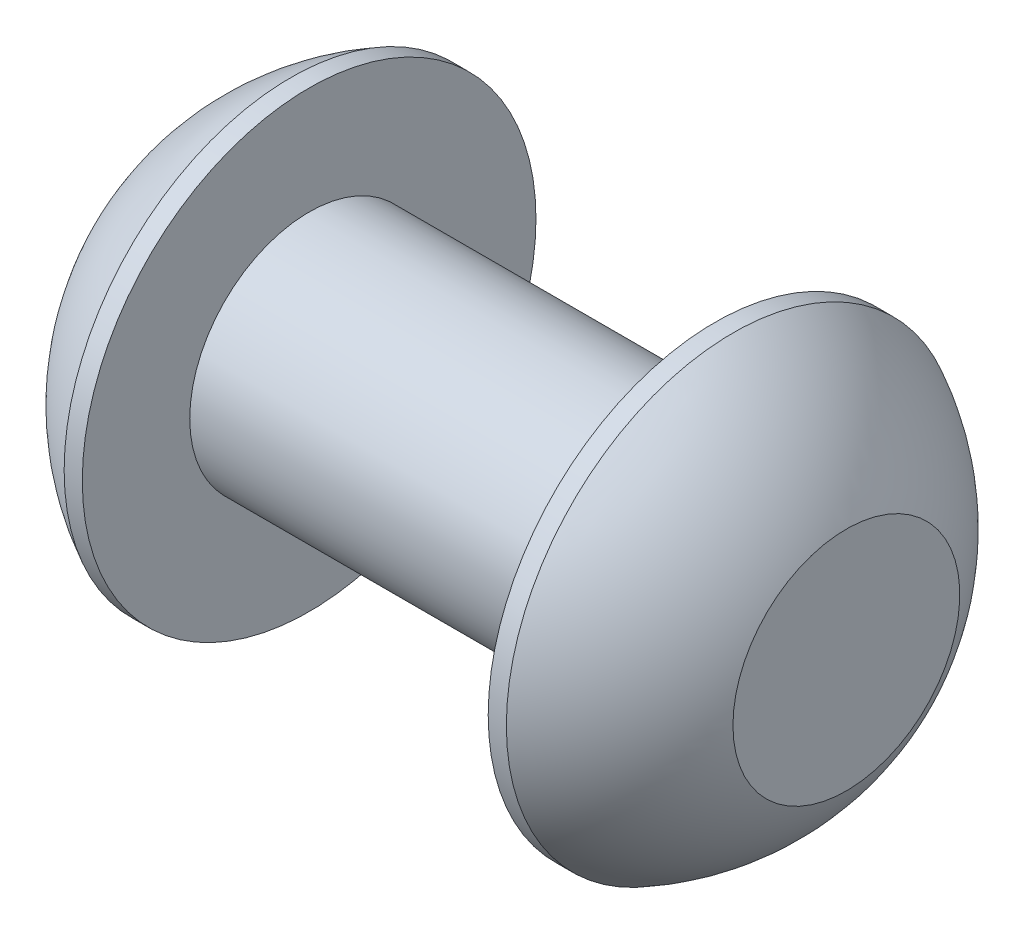
ISO-10303-21;
HEADER;
FILE_DESCRIPTION(('STEP AP214'),'2;1');
FILE_NAME('part.step','',(''),(''),'','','');
FILE_SCHEMA(('AUTOMOTIVE_DESIGN { 1 0 10303 214 1 1 1 1 }'));
ENDSEC;
DATA;
#1=APPLICATION_CONTEXT('core data for automotive mechanical design processes');
#2=APPLICATION_PROTOCOL_DEFINITION('international standard','automotive_design',2000,#1);
#3=PRODUCT_CONTEXT('',#1,'mechanical');
#4=PRODUCT('Part','Part','',(#3));
#5=PRODUCT_RELATED_PRODUCT_CATEGORY('part','',(#4));
#6=PRODUCT_DEFINITION_FORMATION('','',#4);
#7=PRODUCT_DEFINITION_CONTEXT('part definition',#1,'design');
#8=PRODUCT_DEFINITION('design','',#6,#7);
#9=PRODUCT_DEFINITION_SHAPE('','',#8);
#10=(LENGTH_UNIT() NAMED_UNIT(*) SI_UNIT(.MILLI.,.METRE.));
#11=(NAMED_UNIT(*) PLANE_ANGLE_UNIT() SI_UNIT($,.RADIAN.));
#12=(NAMED_UNIT(*) SI_UNIT($,.STERADIAN.) SOLID_ANGLE_UNIT());
#13=UNCERTAINTY_MEASURE_WITH_UNIT(LENGTH_MEASURE(1.E-05),#10,'distance_accuracy_value','');
#14=(GEOMETRIC_REPRESENTATION_CONTEXT(3) GLOBAL_UNCERTAINTY_ASSIGNED_CONTEXT((#13)) GLOBAL_UNIT_ASSIGNED_CONTEXT((#10,
#11,#12)) REPRESENTATION_CONTEXT('',''));
#15=CARTESIAN_POINT('',(0.,0.,0.));
#16=DIRECTION('',(0.,0.,1.));
#17=DIRECTION('',(1.,0.,0.));
#18=AXIS2_PLACEMENT_3D('',#15,#16,#17);
#19=CARTESIAN_POINT('',(4.75501582278481,0.,0.));
#20=DIRECTION('',(-1.,0.,0.));
#21=DIRECTION('',(0.,1.,0.));
#22=AXIS2_PLACEMENT_3D('',#19,#20,#21);
#23=SPHERICAL_SURFACE('',#22,5.3151482081814);
#24=CARTESIAN_POINT('',(2.37,0.,0.));
#25=DIRECTION('',(-1.,0.,0.));
#26=DIRECTION('',(0.,0.,1.));
#27=AXIS2_PLACEMENT_3D('',#24,#25,#26);
#28=CIRCLE('',#27,4.75);
#29=CARTESIAN_POINT('',(2.37,0.,4.75));
#30=VERTEX_POINT('',#29);
#31=EDGE_CURVE('E60',#30,#30,#28,.T.);
#32=ORIENTED_EDGE('',*,*,#31,.T.);
#33=EDGE_LOOP('',(#32));
#34=FACE_BOUND('',#33,.T.);
#35=CARTESIAN_POINT('',(0.,0.,0.));
#36=DIRECTION('',(-1.,0.,0.));
#37=DIRECTION('',(0.,0.,1.));
#38=AXIS2_PLACEMENT_3D('',#35,#36,#37);
#39=CIRCLE('',#38,2.375);
#40=CARTESIAN_POINT('',(0.,0.,2.375));
#41=VERTEX_POINT('',#40);
#42=EDGE_CURVE('E10',#41,#41,#39,.T.);
#43=ORIENTED_EDGE('',*,*,#42,.F.);
#44=EDGE_LOOP('',(#43));
#45=FACE_BOUND('',#44,.T.);
#46=ADVANCED_FACE('F32',(#34,#45),#23,.T.);
#47=CARTESIAN_POINT('',(0.,0.,0.));
#48=DIRECTION('',(-1.,0.,0.));
#49=DIRECTION('',(0.,0.,1.));
#50=AXIS2_PLACEMENT_3D('',#47,#48,#49);
#51=PLANE('',#50);
#52=ORIENTED_EDGE('',*,*,#42,.T.);
#53=EDGE_LOOP('',(#52));
#54=FACE_BOUND('',#53,.T.);
#55=ADVANCED_FACE('F96',(#54),#51,.T.);
#56=CARTESIAN_POINT('',(14.,0.,0.));
#57=DIRECTION('',(-1.,0.,0.));
#58=DIRECTION('',(0.,0.,1.));
#59=AXIS2_PLACEMENT_3D('',#56,#57,#58);
#60=PLANE('',#59);
#61=CARTESIAN_POINT('',(14.,0.,0.));
#62=DIRECTION('',(-1.,0.,0.));
#63=DIRECTION('',(0.,0.,1.));
#64=AXIS2_PLACEMENT_3D('',#61,#62,#63);
#65=CIRCLE('',#64,2.375);
#66=CARTESIAN_POINT('',(14.,0.,2.375));
#67=VERTEX_POINT('',#66);
#68=EDGE_CURVE('E38',#67,#67,#65,.T.);
#69=ORIENTED_EDGE('',*,*,#68,.F.);
#70=EDGE_LOOP('',(#69));
#71=FACE_BOUND('',#70,.T.);
#72=ADVANCED_FACE('F100',(#71),#60,.F.);
#73=CARTESIAN_POINT('',(9.2449841772152,0.,0.));
#74=DIRECTION('',(-1.,0.,0.));
#75=DIRECTION('',(0.,1.,0.));
#76=AXIS2_PLACEMENT_3D('',#73,#74,#75);
#77=SPHERICAL_SURFACE('',#76,5.31514820818139);
#78=CARTESIAN_POINT('',(11.63,0.,0.));
#79=DIRECTION('',(-1.,0.,0.));
#80=DIRECTION('',(0.,0.,1.));
#81=AXIS2_PLACEMENT_3D('',#78,#79,#80);
#82=CIRCLE('',#81,4.74999999999999);
#83=CARTESIAN_POINT('',(11.63,0.,4.74999999999999));
#84=VERTEX_POINT('',#83);
#85=EDGE_CURVE('E42',#84,#84,#82,.T.);
#86=ORIENTED_EDGE('',*,*,#85,.F.);
#87=EDGE_LOOP('',(#86));
#88=FACE_BOUND('',#87,.T.);
#89=ORIENTED_EDGE('',*,*,#68,.T.);
#90=EDGE_LOOP('',(#89));
#91=FACE_BOUND('',#90,.T.);
#92=ADVANCED_FACE('F92',(#88,#91),#77,.T.);
#93=CARTESIAN_POINT('',(-1.17811458216011,0.,0.));
#94=DIRECTION('',(-1.,0.,0.));
#95=DIRECTION('',(0.,0.,1.));
#96=AXIS2_PLACEMENT_3D('',#93,#94,#95);
#97=CYLINDRICAL_SURFACE('',#96,4.74999999999999);
#98=ORIENTED_EDGE('',*,*,#85,.T.);
#99=EDGE_LOOP('',(#98));
#100=FACE_BOUND('',#99,.T.);
#101=CARTESIAN_POINT('',(11.25,0.,0.));
#102=DIRECTION('',(-1.,0.,0.));
#103=DIRECTION('',(0.,0.,1.));
#104=AXIS2_PLACEMENT_3D('',#101,#102,#103);
#105=CIRCLE('',#104,4.74999999999999);
#106=CARTESIAN_POINT('',(11.25,0.,4.74999999999999));
#107=VERTEX_POINT('',#106);
#108=EDGE_CURVE('E46',#107,#107,#105,.T.);
#109=ORIENTED_EDGE('',*,*,#108,.F.);
#110=EDGE_LOOP('',(#109));
#111=FACE_BOUND('',#110,.T.);
#112=ADVANCED_FACE('F86',(#100,#111),#97,.T.);
#113=CARTESIAN_POINT('',(11.25,0.,0.));
#114=DIRECTION('',(-1.,0.,0.));
#115=DIRECTION('',(0.,0.,1.));
#116=AXIS2_PLACEMENT_3D('',#113,#114,#115);
#117=PLANE('',#116);
#118=ORIENTED_EDGE('',*,*,#108,.T.);
#119=EDGE_LOOP('',(#118));
#120=FACE_BOUND('',#119,.T.);
#121=CARTESIAN_POINT('',(11.25,0.,0.));
#122=DIRECTION('',(-1.,0.,0.));
#123=DIRECTION('',(0.,0.,1.));
#124=AXIS2_PLACEMENT_3D('',#121,#122,#123);
#125=CIRCLE('',#124,2.5);
#126=CARTESIAN_POINT('',(11.25,0.,2.5));
#127=VERTEX_POINT('',#126);
#128=EDGE_CURVE('E51',#127,#127,#125,.T.);
#129=ORIENTED_EDGE('',*,*,#128,.F.);
#130=EDGE_LOOP('',(#129));
#131=FACE_BOUND('',#130,.T.);
#132=ADVANCED_FACE('F81',(#120,#131),#117,.T.);
#133=CARTESIAN_POINT('',(-1.17811458216011,0.,0.));
#134=DIRECTION('',(-1.,0.,0.));
#135=DIRECTION('',(0.,0.,1.));
#136=AXIS2_PLACEMENT_3D('',#133,#134,#135);
#137=CYLINDRICAL_SURFACE('',#136,2.5);
#138=CARTESIAN_POINT('',(2.75,0.,0.));
#139=DIRECTION('',(-1.,0.,0.));
#140=DIRECTION('',(0.,0.,1.));
#141=AXIS2_PLACEMENT_3D('',#138,#139,#140);
#142=CIRCLE('',#141,2.5);
#143=CARTESIAN_POINT('',(2.75,0.,2.5));
#144=VERTEX_POINT('',#143);
#145=EDGE_CURVE('E54',#144,#144,#142,.T.);
#146=ORIENTED_EDGE('',*,*,#145,.F.);
#147=EDGE_LOOP('',(#146));
#148=FACE_BOUND('',#147,.T.);
#149=ORIENTED_EDGE('',*,*,#128,.T.);
#150=EDGE_LOOP('',(#149));
#151=FACE_BOUND('',#150,.T.);
#152=ADVANCED_FACE('F75',(#148,#151),#137,.T.);
#153=CARTESIAN_POINT('',(2.75,0.,0.));
#154=DIRECTION('',(-1.,0.,0.));
#155=DIRECTION('',(0.,0.,1.));
#156=AXIS2_PLACEMENT_3D('',#153,#154,#155);
#157=PLANE('',#156);
#158=CARTESIAN_POINT('',(2.75,0.,0.));
#159=DIRECTION('',(-1.,0.,0.));
#160=DIRECTION('',(0.,0.,1.));
#161=AXIS2_PLACEMENT_3D('',#158,#159,#160);
#162=CIRCLE('',#161,4.75);
#163=CARTESIAN_POINT('',(2.75,0.,4.75));
#164=VERTEX_POINT('',#163);
#165=EDGE_CURVE('E57',#164,#164,#162,.T.);
#166=ORIENTED_EDGE('',*,*,#165,.F.);
#167=EDGE_LOOP('',(#166));
#168=FACE_BOUND('',#167,.T.);
#169=ORIENTED_EDGE('',*,*,#145,.T.);
#170=EDGE_LOOP('',(#169));
#171=FACE_BOUND('',#170,.T.);
#172=ADVANCED_FACE('F69',(#168,#171),#157,.F.);
#173=CARTESIAN_POINT('',(-1.17811458216011,0.,0.));
#174=DIRECTION('',(-1.,0.,0.));
#175=DIRECTION('',(0.,0.,1.));
#176=AXIS2_PLACEMENT_3D('',#173,#174,#175);
#177=CYLINDRICAL_SURFACE('',#176,4.75);
#178=ORIENTED_EDGE('',*,*,#31,.F.);
#179=EDGE_LOOP('',(#178));
#180=FACE_BOUND('',#179,.T.);
#181=ORIENTED_EDGE('',*,*,#165,.T.);
#182=EDGE_LOOP('',(#181));
#183=FACE_BOUND('',#182,.T.);
#184=ADVANCED_FACE('F66',(#180,#183),#177,.T.);
#185=CLOSED_SHELL('',(#46,#55,#72,#92,#112,#132,#152,#172,#184));
#186=MANIFOLD_SOLID_BREP('B2',#185);
#187=ADVANCED_BREP_SHAPE_REPRESENTATION('',(#18,#186),#14);
#188=SHAPE_DEFINITION_REPRESENTATION(#9,#187);
ENDSEC;
END-ISO-10303-21;
